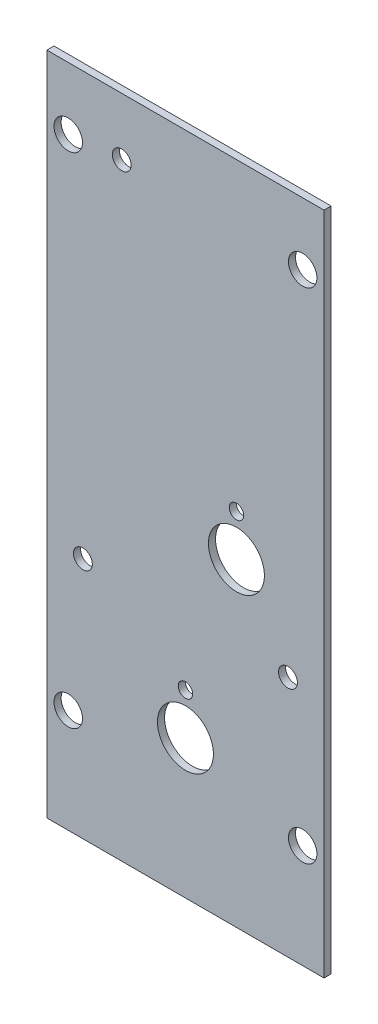
ISO-10303-21;
HEADER;
FILE_DESCRIPTION(('STEP AP214'),'2;1');
FILE_NAME('part.step','',(''),(''),'','','');
FILE_SCHEMA(('AUTOMOTIVE_DESIGN { 1 0 10303 214 1 1 1 1 }'));
ENDSEC;
DATA;
#1=APPLICATION_CONTEXT('core data for automotive mechanical design processes');
#2=APPLICATION_PROTOCOL_DEFINITION('international standard','automotive_design',2000,#1);
#3=PRODUCT_CONTEXT('',#1,'mechanical');
#4=PRODUCT('Part','Part','',(#3));
#5=PRODUCT_RELATED_PRODUCT_CATEGORY('part','',(#4));
#6=PRODUCT_DEFINITION_FORMATION('','',#4);
#7=PRODUCT_DEFINITION_CONTEXT('part definition',#1,'design');
#8=PRODUCT_DEFINITION('design','',#6,#7);
#9=PRODUCT_DEFINITION_SHAPE('','',#8);
#10=(LENGTH_UNIT() NAMED_UNIT(*) SI_UNIT(.MILLI.,.METRE.));
#11=(NAMED_UNIT(*) PLANE_ANGLE_UNIT() SI_UNIT($,.RADIAN.));
#12=(NAMED_UNIT(*) SI_UNIT($,.STERADIAN.) SOLID_ANGLE_UNIT());
#13=UNCERTAINTY_MEASURE_WITH_UNIT(LENGTH_MEASURE(1.E-05),#10,'distance_accuracy_value','');
#14=(GEOMETRIC_REPRESENTATION_CONTEXT(3) GLOBAL_UNCERTAINTY_ASSIGNED_CONTEXT((#13)) GLOBAL_UNIT_ASSIGNED_CONTEXT((#10,
#11,#12)) REPRESENTATION_CONTEXT('',''));
#15=CARTESIAN_POINT('',(0.,0.,0.));
#16=DIRECTION('',(0.,0.,1.));
#17=DIRECTION('',(1.,0.,0.));
#18=AXIS2_PLACEMENT_3D('',#15,#16,#17);
#19=CARTESIAN_POINT('',(31.75,76.2,0.));
#20=DIRECTION('',(0.,0.,1.));
#21=DIRECTION('',(1.,0.,0.));
#22=AXIS2_PLACEMENT_3D('',#19,#20,#21);
#23=PLANE('',#22);
#24=CARTESIAN_POINT('',(4.88949999999967,23.8125,0.));
#25=DIRECTION('',(0.,0.,-1.));
#26=DIRECTION('',(-1.,0.,0.));
#27=AXIS2_PLACEMENT_3D('',#24,#25,#26);
#28=CIRCLE('',#27,3.2639);
#29=CARTESIAN_POINT('',(1.62559999999967,23.8125,0.));
#30=VERTEX_POINT('',#29);
#31=EDGE_CURVE('E114',#30,#30,#28,.F.);
#32=ORIENTED_EDGE('',*,*,#31,.T.);
#33=EDGE_LOOP('',(#32));
#34=FACE_BOUND('',#33,.T.);
#35=CARTESIAN_POINT('',(4.88949999999975,138.1125,0.));
#36=DIRECTION('',(0.,0.,-1.));
#37=DIRECTION('',(-1.,0.,0.));
#38=AXIS2_PLACEMENT_3D('',#35,#36,#37);
#39=CIRCLE('',#38,3.2639);
#40=CARTESIAN_POINT('',(1.62559999999975,138.1125,0.));
#41=VERTEX_POINT('',#40);
#42=EDGE_CURVE('E118',#41,#41,#39,.F.);
#43=ORIENTED_EDGE('',*,*,#42,.T.);
#44=EDGE_LOOP('',(#43));
#45=FACE_BOUND('',#44,.T.);
#46=CARTESIAN_POINT('',(58.6105,23.8125,0.));
#47=DIRECTION('',(0.,0.,-1.));
#48=DIRECTION('',(-1.,0.,0.));
#49=AXIS2_PLACEMENT_3D('',#46,#47,#48);
#50=CIRCLE('',#49,3.2639);
#51=CARTESIAN_POINT('',(55.3466,23.8125,0.));
#52=VERTEX_POINT('',#51);
#53=EDGE_CURVE('E121',#52,#52,#50,.F.);
#54=ORIENTED_EDGE('',*,*,#53,.T.);
#55=EDGE_LOOP('',(#54));
#56=FACE_BOUND('',#55,.T.);
#57=CARTESIAN_POINT('',(58.6105,138.1125,0.));
#58=DIRECTION('',(0.,0.,-1.));
#59=DIRECTION('',(-1.,0.,0.));
#60=AXIS2_PLACEMENT_3D('',#57,#58,#59);
#61=CIRCLE('',#60,3.2639);
#62=CARTESIAN_POINT('',(55.3466,138.1125,0.));
#63=VERTEX_POINT('',#62);
#64=EDGE_CURVE('E124',#63,#63,#61,.F.);
#65=ORIENTED_EDGE('',*,*,#64,.T.);
#66=EDGE_LOOP('',(#65));
#67=FACE_BOUND('',#66,.T.);
#68=CARTESIAN_POINT('',(17.145,139.192,0.));
#69=DIRECTION('',(0.,0.,-1.));
#70=DIRECTION('',(-1.,0.,0.));
#71=AXIS2_PLACEMENT_3D('',#68,#69,#70);
#72=CIRCLE('',#71,2.159);
#73=CARTESIAN_POINT('',(14.986,139.192,0.));
#74=VERTEX_POINT('',#73);
#75=EDGE_CURVE('E127',#74,#74,#72,.F.);
#76=ORIENTED_EDGE('',*,*,#75,.T.);
#77=EDGE_LOOP('',(#76));
#78=FACE_BOUND('',#77,.T.);
#79=CARTESIAN_POINT('',(55.245,55.5625,0.));
#80=DIRECTION('',(0.,0.,-1.));
#81=DIRECTION('',(-1.,0.,0.));
#82=AXIS2_PLACEMENT_3D('',#79,#80,#81);
#83=CIRCLE('',#82,2.15900000000001);
#84=CARTESIAN_POINT('',(53.086,55.5625,0.));
#85=VERTEX_POINT('',#84);
#86=EDGE_CURVE('E130',#85,#85,#83,.F.);
#87=ORIENTED_EDGE('',*,*,#86,.T.);
#88=EDGE_LOOP('',(#87));
#89=FACE_BOUND('',#88,.T.);
#90=CARTESIAN_POINT('',(8.255,55.5625,0.));
#91=DIRECTION('',(0.,0.,-1.));
#92=DIRECTION('',(-1.,0.,0.));
#93=AXIS2_PLACEMENT_3D('',#90,#91,#92);
#94=CIRCLE('',#93,2.159);
#95=CARTESIAN_POINT('',(6.096,55.5625,0.));
#96=VERTEX_POINT('',#95);
#97=EDGE_CURVE('E133',#96,#96,#94,.F.);
#98=ORIENTED_EDGE('',*,*,#97,.T.);
#99=EDGE_LOOP('',(#98));
#100=FACE_BOUND('',#99,.T.);
#101=CARTESIAN_POINT('',(31.75,41.275,0.));
#102=DIRECTION('',(0.,0.,-1.));
#103=DIRECTION('',(-1.,0.,0.));
#104=AXIS2_PLACEMENT_3D('',#101,#102,#103);
#105=CIRCLE('',#104,1.651);
#106=CARTESIAN_POINT('',(30.099,41.275,0.));
#107=VERTEX_POINT('',#106);
#108=EDGE_CURVE('E136',#107,#107,#105,.F.);
#109=ORIENTED_EDGE('',*,*,#108,.T.);
#110=EDGE_LOOP('',(#109));
#111=FACE_BOUND('',#110,.T.);
#112=CARTESIAN_POINT('',(31.75,31.75,0.));
#113=DIRECTION('',(0.,0.,-1.));
#114=DIRECTION('',(-1.,0.,0.));
#115=AXIS2_PLACEMENT_3D('',#112,#113,#114);
#116=CIRCLE('',#115,6.4135);
#117=CARTESIAN_POINT('',(25.3365,31.75,0.));
#118=VERTEX_POINT('',#117);
#119=EDGE_CURVE('E139',#118,#118,#116,.F.);
#120=ORIENTED_EDGE('',*,*,#119,.T.);
#121=EDGE_LOOP('',(#120));
#122=FACE_BOUND('',#121,.T.);
#123=CARTESIAN_POINT('',(43.434,82.55,0.));
#124=DIRECTION('',(0.,0.,-1.));
#125=DIRECTION('',(-1.,0.,0.));
#126=AXIS2_PLACEMENT_3D('',#123,#124,#125);
#127=CIRCLE('',#126,1.651);
#128=CARTESIAN_POINT('',(41.783,82.55,0.));
#129=VERTEX_POINT('',#128);
#130=EDGE_CURVE('E141',#129,#129,#127,.F.);
#131=ORIENTED_EDGE('',*,*,#130,.T.);
#132=EDGE_LOOP('',(#131));
#133=FACE_BOUND('',#132,.T.);
#134=CARTESIAN_POINT('',(43.434,73.025,0.));
#135=DIRECTION('',(0.,0.,-1.));
#136=DIRECTION('',(-1.,0.,0.));
#137=AXIS2_PLACEMENT_3D('',#134,#135,#136);
#138=CIRCLE('',#137,6.4135);
#139=CARTESIAN_POINT('',(37.0205,73.025,0.));
#140=VERTEX_POINT('',#139);
#141=EDGE_CURVE('E20',#140,#140,#138,.F.);
#142=ORIENTED_EDGE('',*,*,#141,.T.);
#143=EDGE_LOOP('',(#142));
#144=FACE_BOUND('',#143,.T.);
#145=DIRECTION('',(1.,0.,0.));
#146=VECTOR('',#145,1.);
#147=CARTESIAN_POINT('',(63.5,152.4,0.));
#148=LINE('',#147,#146);
#149=CARTESIAN_POINT('',(63.5,152.4,0.));
#150=VERTEX_POINT('',#149);
#151=CARTESIAN_POINT('',(0.,152.4,0.));
#152=VERTEX_POINT('',#151);
#153=EDGE_CURVE('E152',#150,#152,#148,.F.);
#154=ORIENTED_EDGE('',*,*,#153,.F.);
#155=DIRECTION('',(0.,1.,0.));
#156=VECTOR('',#155,1.);
#157=CARTESIAN_POINT('',(63.5,0.,0.));
#158=LINE('',#157,#156);
#159=CARTESIAN_POINT('',(63.5,0.,0.));
#160=VERTEX_POINT('',#159);
#161=EDGE_CURVE('E55',#160,#150,#158,.T.);
#162=ORIENTED_EDGE('',*,*,#161,.F.);
#163=DIRECTION('',(1.,0.,0.));
#164=VECTOR('',#163,1.);
#165=CARTESIAN_POINT('',(0.,0.,0.));
#166=LINE('',#165,#164);
#167=CARTESIAN_POINT('',(0.,0.,0.));
#168=VERTEX_POINT('',#167);
#169=EDGE_CURVE('E57',#168,#160,#166,.T.);
#170=ORIENTED_EDGE('',*,*,#169,.F.);
#171=DIRECTION('',(0.,1.,0.));
#172=VECTOR('',#171,1.);
#173=CARTESIAN_POINT('',(0.,152.4,0.));
#174=LINE('',#173,#172);
#175=EDGE_CURVE('E59',#152,#168,#174,.F.);
#176=ORIENTED_EDGE('',*,*,#175,.F.);
#177=EDGE_LOOP('',(#154,#162,#170,#176));
#178=FACE_BOUND('',#177,.T.);
#179=ADVANCED_FACE('F17',(#34,#45,#56,#67,#78,#89,#100,#111,#122,#133,#144,#178),#23,.F.);
#180=CARTESIAN_POINT('',(0.,152.4,0.));
#181=DIRECTION('',(-1.,0.,0.));
#182=DIRECTION('',(0.,0.,1.));
#183=AXIS2_PLACEMENT_3D('',#180,#181,#182);
#184=PLANE('',#183);
#185=DIRECTION('',(0.,1.,0.));
#186=VECTOR('',#185,1.);
#187=CARTESIAN_POINT('',(0.,76.2,1.6256));
#188=LINE('',#187,#186);
#189=CARTESIAN_POINT('',(0.,152.4,1.6256));
#190=VERTEX_POINT('',#189);
#191=CARTESIAN_POINT('',(0.,0.,1.6256));
#192=VERTEX_POINT('',#191);
#193=EDGE_CURVE('E117',#190,#192,#188,.F.);
#194=ORIENTED_EDGE('',*,*,#193,.F.);
#195=DIRECTION('',(0.,0.,1.));
#196=VECTOR('',#195,1.);
#197=CARTESIAN_POINT('',(0.,152.4,0.));
#198=LINE('',#197,#196);
#199=EDGE_CURVE('E70',#152,#190,#198,.T.);
#200=ORIENTED_EDGE('',*,*,#199,.F.);
#201=ORIENTED_EDGE('',*,*,#175,.T.);
#202=DIRECTION('',(0.,0.,-1.));
#203=VECTOR('',#202,1.);
#204=CARTESIAN_POINT('',(0.,0.,0.));
#205=LINE('',#204,#203);
#206=EDGE_CURVE('E64',#192,#168,#205,.T.);
#207=ORIENTED_EDGE('',*,*,#206,.F.);
#208=EDGE_LOOP('',(#194,#200,#201,#207));
#209=FACE_BOUND('',#208,.T.);
#210=ADVANCED_FACE('F67',(#209),#184,.T.);
#211=CARTESIAN_POINT('',(0.,0.,0.));
#212=DIRECTION('',(0.,-1.,0.));
#213=DIRECTION('',(0.,0.,-1.));
#214=AXIS2_PLACEMENT_3D('',#211,#212,#213);
#215=PLANE('',#214);
#216=DIRECTION('',(1.,0.,0.));
#217=VECTOR('',#216,1.);
#218=CARTESIAN_POINT('',(31.75,0.,1.6256));
#219=LINE('',#218,#217);
#220=CARTESIAN_POINT('',(63.5,0.,1.6256));
#221=VERTEX_POINT('',#220);
#222=EDGE_CURVE('E75',#192,#221,#219,.T.);
#223=ORIENTED_EDGE('',*,*,#222,.F.);
#224=ORIENTED_EDGE('',*,*,#206,.T.);
#225=ORIENTED_EDGE('',*,*,#169,.T.);
#226=DIRECTION('',(0.,0.,-1.));
#227=VECTOR('',#226,1.);
#228=CARTESIAN_POINT('',(63.5,0.,0.));
#229=LINE('',#228,#227);
#230=EDGE_CURVE('E78',#221,#160,#229,.T.);
#231=ORIENTED_EDGE('',*,*,#230,.F.);
#232=EDGE_LOOP('',(#223,#224,#225,#231));
#233=FACE_BOUND('',#232,.T.);
#234=ADVANCED_FACE('F73',(#233),#215,.T.);
#235=CARTESIAN_POINT('',(63.5,0.,0.));
#236=DIRECTION('',(1.,0.,0.));
#237=DIRECTION('',(0.,0.,-1.));
#238=AXIS2_PLACEMENT_3D('',#235,#236,#237);
#239=PLANE('',#238);
#240=DIRECTION('',(0.,1.,0.));
#241=VECTOR('',#240,1.);
#242=CARTESIAN_POINT('',(63.5,76.2,1.6256));
#243=LINE('',#242,#241);
#244=CARTESIAN_POINT('',(63.5,152.4,1.6256));
#245=VERTEX_POINT('',#244);
#246=EDGE_CURVE('E159',#221,#245,#243,.T.);
#247=ORIENTED_EDGE('',*,*,#246,.F.);
#248=ORIENTED_EDGE('',*,*,#230,.T.);
#249=ORIENTED_EDGE('',*,*,#161,.T.);
#250=DIRECTION('',(0.,0.,1.));
#251=VECTOR('',#250,1.);
#252=CARTESIAN_POINT('',(63.5,152.4,0.));
#253=LINE('',#252,#251);
#254=EDGE_CURVE('E35',#245,#150,#253,.F.);
#255=ORIENTED_EDGE('',*,*,#254,.F.);
#256=EDGE_LOOP('',(#247,#248,#249,#255));
#257=FACE_BOUND('',#256,.T.);
#258=ADVANCED_FACE('F157',(#257),#239,.T.);
#259=CARTESIAN_POINT('',(63.5,152.4,0.));
#260=DIRECTION('',(0.,1.,0.));
#261=DIRECTION('',(0.,0.,1.));
#262=AXIS2_PLACEMENT_3D('',#259,#260,#261);
#263=PLANE('',#262);
#264=DIRECTION('',(1.,0.,0.));
#265=VECTOR('',#264,1.);
#266=CARTESIAN_POINT('',(31.75,152.4,1.6256));
#267=LINE('',#266,#265);
#268=EDGE_CURVE('E113',#245,#190,#267,.F.);
#269=ORIENTED_EDGE('',*,*,#268,.F.);
#270=ORIENTED_EDGE('',*,*,#254,.T.);
#271=ORIENTED_EDGE('',*,*,#153,.T.);
#272=ORIENTED_EDGE('',*,*,#199,.T.);
#273=EDGE_LOOP('',(#269,#270,#271,#272));
#274=FACE_BOUND('',#273,.T.);
#275=ADVANCED_FACE('F165',(#274),#263,.T.);
#276=CARTESIAN_POINT('',(43.434,73.025,1.6256));
#277=DIRECTION('',(0.,0.,-1.));
#278=DIRECTION('',(-1.,0.,0.));
#279=AXIS2_PLACEMENT_3D('',#276,#277,#278);
#280=CYLINDRICAL_SURFACE('',#279,6.4135);
#281=ORIENTED_EDGE('',*,*,#141,.F.);
#282=EDGE_LOOP('',(#281));
#283=FACE_BOUND('',#282,.T.);
#284=CARTESIAN_POINT('',(43.434,73.025,1.6256));
#285=DIRECTION('',(0.,0.,-1.));
#286=DIRECTION('',(-1.,0.,0.));
#287=AXIS2_PLACEMENT_3D('',#284,#285,#286);
#288=CIRCLE('',#287,6.4135);
#289=CARTESIAN_POINT('',(37.0205,73.025,1.6256));
#290=VERTEX_POINT('',#289);
#291=EDGE_CURVE('E109',#290,#290,#288,.T.);
#292=ORIENTED_EDGE('',*,*,#291,.F.);
#293=EDGE_LOOP('',(#292));
#294=FACE_BOUND('',#293,.T.);
#295=ADVANCED_FACE('F167',(#283,#294),#280,.F.);
#296=CARTESIAN_POINT('',(43.434,82.55,1.6256));
#297=DIRECTION('',(0.,0.,-1.));
#298=DIRECTION('',(-1.,0.,0.));
#299=AXIS2_PLACEMENT_3D('',#296,#297,#298);
#300=CYLINDRICAL_SURFACE('',#299,1.651);
#301=ORIENTED_EDGE('',*,*,#130,.F.);
#302=EDGE_LOOP('',(#301));
#303=FACE_BOUND('',#302,.T.);
#304=CARTESIAN_POINT('',(43.434,82.55,1.6256));
#305=DIRECTION('',(0.,0.,-1.));
#306=DIRECTION('',(-1.,0.,0.));
#307=AXIS2_PLACEMENT_3D('',#304,#305,#306);
#308=CIRCLE('',#307,1.651);
#309=CARTESIAN_POINT('',(41.783,82.55,1.6256));
#310=VERTEX_POINT('',#309);
#311=EDGE_CURVE('E105',#310,#310,#308,.T.);
#312=ORIENTED_EDGE('',*,*,#311,.F.);
#313=EDGE_LOOP('',(#312));
#314=FACE_BOUND('',#313,.T.);
#315=ADVANCED_FACE('F174',(#303,#314),#300,.F.);
#316=CARTESIAN_POINT('',(31.75,31.75,1.6256));
#317=DIRECTION('',(0.,0.,-1.));
#318=DIRECTION('',(-1.,0.,0.));
#319=AXIS2_PLACEMENT_3D('',#316,#317,#318);
#320=CYLINDRICAL_SURFACE('',#319,6.4135);
#321=ORIENTED_EDGE('',*,*,#119,.F.);
#322=EDGE_LOOP('',(#321));
#323=FACE_BOUND('',#322,.T.);
#324=CARTESIAN_POINT('',(31.75,31.75,1.6256));
#325=DIRECTION('',(0.,0.,-1.));
#326=DIRECTION('',(-1.,0.,0.));
#327=AXIS2_PLACEMENT_3D('',#324,#325,#326);
#328=CIRCLE('',#327,6.4135);
#329=CARTESIAN_POINT('',(25.3365,31.75,1.6256));
#330=VERTEX_POINT('',#329);
#331=EDGE_CURVE('E102',#330,#330,#328,.T.);
#332=ORIENTED_EDGE('',*,*,#331,.F.);
#333=EDGE_LOOP('',(#332));
#334=FACE_BOUND('',#333,.T.);
#335=ADVANCED_FACE('F216',(#323,#334),#320,.F.);
#336=CARTESIAN_POINT('',(31.75,41.275,1.6256));
#337=DIRECTION('',(0.,0.,-1.));
#338=DIRECTION('',(-1.,0.,0.));
#339=AXIS2_PLACEMENT_3D('',#336,#337,#338);
#340=CYLINDRICAL_SURFACE('',#339,1.651);
#341=ORIENTED_EDGE('',*,*,#108,.F.);
#342=EDGE_LOOP('',(#341));
#343=FACE_BOUND('',#342,.T.);
#344=CARTESIAN_POINT('',(31.75,41.275,1.6256));
#345=DIRECTION('',(0.,0.,-1.));
#346=DIRECTION('',(-1.,0.,0.));
#347=AXIS2_PLACEMENT_3D('',#344,#345,#346);
#348=CIRCLE('',#347,1.651);
#349=CARTESIAN_POINT('',(30.099,41.275,1.6256));
#350=VERTEX_POINT('',#349);
#351=EDGE_CURVE('E99',#350,#350,#348,.T.);
#352=ORIENTED_EDGE('',*,*,#351,.F.);
#353=EDGE_LOOP('',(#352));
#354=FACE_BOUND('',#353,.T.);
#355=ADVANCED_FACE('F212',(#343,#354),#340,.F.);
#356=CARTESIAN_POINT('',(8.255,55.5625,7.4676));
#357=DIRECTION('',(0.,0.,-1.));
#358=DIRECTION('',(-1.,0.,0.));
#359=AXIS2_PLACEMENT_3D('',#356,#357,#358);
#360=CYLINDRICAL_SURFACE('',#359,2.159);
#361=ORIENTED_EDGE('',*,*,#97,.F.);
#362=EDGE_LOOP('',(#361));
#363=FACE_BOUND('',#362,.T.);
#364=CARTESIAN_POINT('',(8.255,55.5625,1.6256));
#365=DIRECTION('',(0.,0.,-1.));
#366=DIRECTION('',(-1.,0.,0.));
#367=AXIS2_PLACEMENT_3D('',#364,#365,#366);
#368=CIRCLE('',#367,2.159);
#369=CARTESIAN_POINT('',(6.096,55.5625,1.6256));
#370=VERTEX_POINT('',#369);
#371=EDGE_CURVE('E96',#370,#370,#368,.T.);
#372=ORIENTED_EDGE('',*,*,#371,.F.);
#373=EDGE_LOOP('',(#372));
#374=FACE_BOUND('',#373,.T.);
#375=ADVANCED_FACE('F208',(#363,#374),#360,.F.);
#376=CARTESIAN_POINT('',(55.245,55.5625,7.4676));
#377=DIRECTION('',(0.,0.,-1.));
#378=DIRECTION('',(-1.,0.,0.));
#379=AXIS2_PLACEMENT_3D('',#376,#377,#378);
#380=CYLINDRICAL_SURFACE('',#379,2.15900000000001);
#381=ORIENTED_EDGE('',*,*,#86,.F.);
#382=EDGE_LOOP('',(#381));
#383=FACE_BOUND('',#382,.T.);
#384=CARTESIAN_POINT('',(55.245,55.5625,1.6256));
#385=DIRECTION('',(0.,0.,-1.));
#386=DIRECTION('',(-1.,0.,0.));
#387=AXIS2_PLACEMENT_3D('',#384,#385,#386);
#388=CIRCLE('',#387,2.15900000000001);
#389=CARTESIAN_POINT('',(53.086,55.5625,1.6256));
#390=VERTEX_POINT('',#389);
#391=EDGE_CURVE('E93',#390,#390,#388,.T.);
#392=ORIENTED_EDGE('',*,*,#391,.F.);
#393=EDGE_LOOP('',(#392));
#394=FACE_BOUND('',#393,.T.);
#395=ADVANCED_FACE('F204',(#383,#394),#380,.F.);
#396=CARTESIAN_POINT('',(17.145,139.192,7.4676));
#397=DIRECTION('',(0.,0.,-1.));
#398=DIRECTION('',(-1.,0.,0.));
#399=AXIS2_PLACEMENT_3D('',#396,#397,#398);
#400=CYLINDRICAL_SURFACE('',#399,2.159);
#401=ORIENTED_EDGE('',*,*,#75,.F.);
#402=EDGE_LOOP('',(#401));
#403=FACE_BOUND('',#402,.T.);
#404=CARTESIAN_POINT('',(17.145,139.192,1.6256));
#405=DIRECTION('',(0.,0.,-1.));
#406=DIRECTION('',(-1.,0.,0.));
#407=AXIS2_PLACEMENT_3D('',#404,#405,#406);
#408=CIRCLE('',#407,2.159);
#409=CARTESIAN_POINT('',(14.986,139.192,1.6256));
#410=VERTEX_POINT('',#409);
#411=EDGE_CURVE('E90',#410,#410,#408,.T.);
#412=ORIENTED_EDGE('',*,*,#411,.F.);
#413=EDGE_LOOP('',(#412));
#414=FACE_BOUND('',#413,.T.);
#415=ADVANCED_FACE('F200',(#403,#414),#400,.F.);
#416=CARTESIAN_POINT('',(58.6105,138.1125,1.6256));
#417=DIRECTION('',(0.,0.,-1.));
#418=DIRECTION('',(-1.,0.,0.));
#419=AXIS2_PLACEMENT_3D('',#416,#417,#418);
#420=CYLINDRICAL_SURFACE('',#419,3.2639);
#421=ORIENTED_EDGE('',*,*,#64,.F.);
#422=EDGE_LOOP('',(#421));
#423=FACE_BOUND('',#422,.T.);
#424=CARTESIAN_POINT('',(58.6105,138.1125,1.6256));
#425=DIRECTION('',(0.,0.,-1.));
#426=DIRECTION('',(-1.,0.,0.));
#427=AXIS2_PLACEMENT_3D('',#424,#425,#426);
#428=CIRCLE('',#427,3.2639);
#429=CARTESIAN_POINT('',(55.3466,138.1125,1.6256));
#430=VERTEX_POINT('',#429);
#431=EDGE_CURVE('E87',#430,#430,#428,.T.);
#432=ORIENTED_EDGE('',*,*,#431,.F.);
#433=EDGE_LOOP('',(#432));
#434=FACE_BOUND('',#433,.T.);
#435=ADVANCED_FACE('F196',(#423,#434),#420,.F.);
#436=CARTESIAN_POINT('',(58.6105,23.8125,1.6256));
#437=DIRECTION('',(0.,0.,-1.));
#438=DIRECTION('',(-1.,0.,0.));
#439=AXIS2_PLACEMENT_3D('',#436,#437,#438);
#440=CYLINDRICAL_SURFACE('',#439,3.2639);
#441=ORIENTED_EDGE('',*,*,#53,.F.);
#442=EDGE_LOOP('',(#441));
#443=FACE_BOUND('',#442,.T.);
#444=CARTESIAN_POINT('',(58.6105,23.8125,1.6256));
#445=DIRECTION('',(0.,0.,-1.));
#446=DIRECTION('',(-1.,0.,0.));
#447=AXIS2_PLACEMENT_3D('',#444,#445,#446);
#448=CIRCLE('',#447,3.2639);
#449=CARTESIAN_POINT('',(55.3466,23.8125,1.6256));
#450=VERTEX_POINT('',#449);
#451=EDGE_CURVE('E84',#450,#450,#448,.T.);
#452=ORIENTED_EDGE('',*,*,#451,.F.);
#453=EDGE_LOOP('',(#452));
#454=FACE_BOUND('',#453,.T.);
#455=ADVANCED_FACE('F192',(#443,#454),#440,.F.);
#456=CARTESIAN_POINT('',(4.88949999999975,138.1125,1.6256));
#457=DIRECTION('',(0.,0.,-1.));
#458=DIRECTION('',(-1.,0.,0.));
#459=AXIS2_PLACEMENT_3D('',#456,#457,#458);
#460=CYLINDRICAL_SURFACE('',#459,3.2639);
#461=ORIENTED_EDGE('',*,*,#42,.F.);
#462=EDGE_LOOP('',(#461));
#463=FACE_BOUND('',#462,.T.);
#464=CARTESIAN_POINT('',(4.88949999999975,138.1125,1.6256));
#465=DIRECTION('',(0.,0.,-1.));
#466=DIRECTION('',(-1.,0.,0.));
#467=AXIS2_PLACEMENT_3D('',#464,#465,#466);
#468=CIRCLE('',#467,3.2639);
#469=CARTESIAN_POINT('',(1.62559999999975,138.1125,1.6256));
#470=VERTEX_POINT('',#469);
#471=EDGE_CURVE('E26',#470,#470,#468,.T.);
#472=ORIENTED_EDGE('',*,*,#471,.F.);
#473=EDGE_LOOP('',(#472));
#474=FACE_BOUND('',#473,.T.);
#475=ADVANCED_FACE('F185',(#463,#474),#460,.F.);
#476=CARTESIAN_POINT('',(4.88949999999967,23.8125,1.6256));
#477=DIRECTION('',(0.,0.,-1.));
#478=DIRECTION('',(-1.,0.,0.));
#479=AXIS2_PLACEMENT_3D('',#476,#477,#478);
#480=CYLINDRICAL_SURFACE('',#479,3.2639);
#481=ORIENTED_EDGE('',*,*,#31,.F.);
#482=EDGE_LOOP('',(#481));
#483=FACE_BOUND('',#482,.T.);
#484=CARTESIAN_POINT('',(4.88949999999967,23.8125,1.6256));
#485=DIRECTION('',(0.,0.,-1.));
#486=DIRECTION('',(-1.,0.,0.));
#487=AXIS2_PLACEMENT_3D('',#484,#485,#486);
#488=CIRCLE('',#487,3.2639);
#489=CARTESIAN_POINT('',(1.62559999999967,23.8125,1.6256));
#490=VERTEX_POINT('',#489);
#491=EDGE_CURVE('E11',#490,#490,#488,.T.);
#492=ORIENTED_EDGE('',*,*,#491,.F.);
#493=EDGE_LOOP('',(#492));
#494=FACE_BOUND('',#493,.T.);
#495=ADVANCED_FACE('F179',(#483,#494),#480,.F.);
#496=CARTESIAN_POINT('',(31.75,76.2,1.6256));
#497=DIRECTION('',(0.,0.,1.));
#498=DIRECTION('',(1.,0.,0.));
#499=AXIS2_PLACEMENT_3D('',#496,#497,#498);
#500=PLANE('',#499);
#501=ORIENTED_EDGE('',*,*,#491,.T.);
#502=EDGE_LOOP('',(#501));
#503=FACE_BOUND('',#502,.T.);
#504=ORIENTED_EDGE('',*,*,#471,.T.);
#505=EDGE_LOOP('',(#504));
#506=FACE_BOUND('',#505,.T.);
#507=ORIENTED_EDGE('',*,*,#451,.T.);
#508=EDGE_LOOP('',(#507));
#509=FACE_BOUND('',#508,.T.);
#510=ORIENTED_EDGE('',*,*,#431,.T.);
#511=EDGE_LOOP('',(#510));
#512=FACE_BOUND('',#511,.T.);
#513=ORIENTED_EDGE('',*,*,#411,.T.);
#514=EDGE_LOOP('',(#513));
#515=FACE_BOUND('',#514,.T.);
#516=ORIENTED_EDGE('',*,*,#391,.T.);
#517=EDGE_LOOP('',(#516));
#518=FACE_BOUND('',#517,.T.);
#519=ORIENTED_EDGE('',*,*,#371,.T.);
#520=EDGE_LOOP('',(#519));
#521=FACE_BOUND('',#520,.T.);
#522=ORIENTED_EDGE('',*,*,#351,.T.);
#523=EDGE_LOOP('',(#522));
#524=FACE_BOUND('',#523,.T.);
#525=ORIENTED_EDGE('',*,*,#331,.T.);
#526=EDGE_LOOP('',(#525));
#527=FACE_BOUND('',#526,.T.);
#528=ORIENTED_EDGE('',*,*,#311,.T.);
#529=EDGE_LOOP('',(#528));
#530=FACE_BOUND('',#529,.T.);
#531=ORIENTED_EDGE('',*,*,#291,.T.);
#532=EDGE_LOOP('',(#531));
#533=FACE_BOUND('',#532,.T.);
#534=ORIENTED_EDGE('',*,*,#246,.T.);
#535=ORIENTED_EDGE('',*,*,#268,.T.);
#536=ORIENTED_EDGE('',*,*,#193,.T.);
#537=ORIENTED_EDGE('',*,*,#222,.T.);
#538=EDGE_LOOP('',(#534,#535,#536,#537));
#539=FACE_BOUND('',#538,.T.);
#540=ADVANCED_FACE('F163',(#503,#506,#509,#512,#515,#518,#521,#524,#527,#530,#533,#539),#500,.T.);
#541=CLOSED_SHELL('',(#179,#210,#234,#258,#275,#295,#315,#335,#355,#375,#395,#415,#435,#455,
#475,#495,#540));
#542=MANIFOLD_SOLID_BREP('B1',#541);
#543=ADVANCED_BREP_SHAPE_REPRESENTATION('',(#18,#542),#14);
#544=SHAPE_DEFINITION_REPRESENTATION(#9,#543);
ENDSEC;
END-ISO-10303-21;
